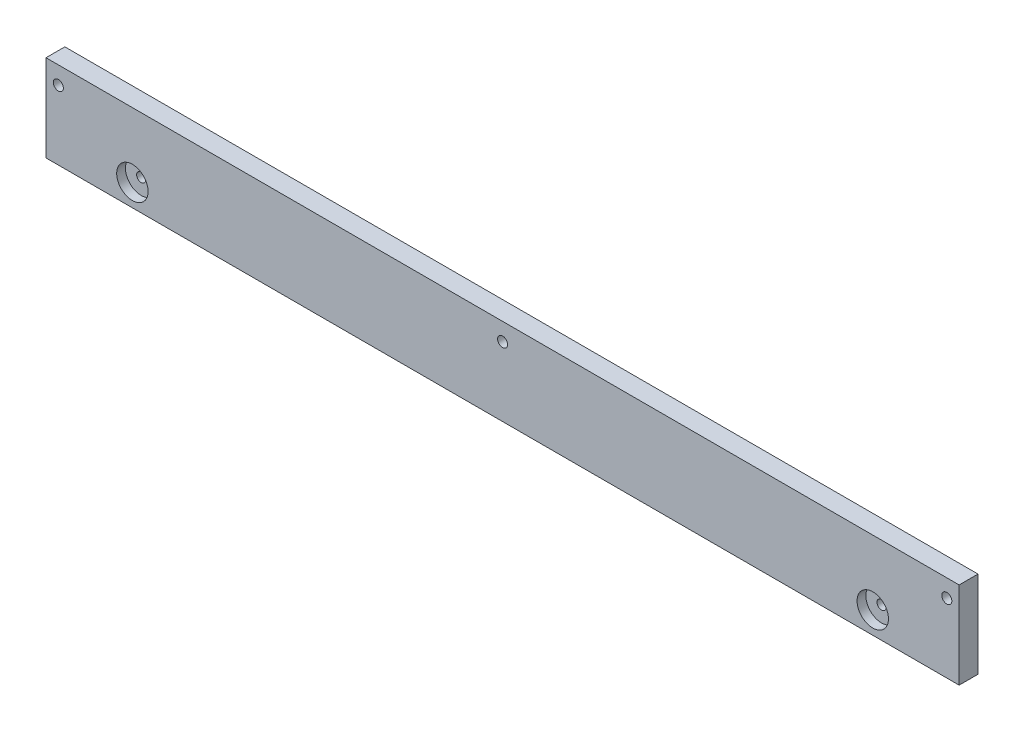
ISO-10303-21;
HEADER;
FILE_DESCRIPTION(('STEP AP214'),'2;1');
FILE_NAME('part.step','',(''),(''),'','','');
FILE_SCHEMA(('AUTOMOTIVE_DESIGN { 1 0 10303 214 1 1 1 1 }'));
ENDSEC;
DATA;
#1=APPLICATION_CONTEXT('core data for automotive mechanical design processes');
#2=APPLICATION_PROTOCOL_DEFINITION('international standard','automotive_design',2000,#1);
#3=PRODUCT_CONTEXT('',#1,'mechanical');
#4=PRODUCT('Part','Part','',(#3));
#5=PRODUCT_RELATED_PRODUCT_CATEGORY('part','',(#4));
#6=PRODUCT_DEFINITION_FORMATION('','',#4);
#7=PRODUCT_DEFINITION_CONTEXT('part definition',#1,'design');
#8=PRODUCT_DEFINITION('design','',#6,#7);
#9=PRODUCT_DEFINITION_SHAPE('','',#8);
#10=(LENGTH_UNIT() NAMED_UNIT(*) SI_UNIT(.MILLI.,.METRE.));
#11=(NAMED_UNIT(*) PLANE_ANGLE_UNIT() SI_UNIT($,.RADIAN.));
#12=(NAMED_UNIT(*) SI_UNIT($,.STERADIAN.) SOLID_ANGLE_UNIT());
#13=UNCERTAINTY_MEASURE_WITH_UNIT(LENGTH_MEASURE(1.E-05),#10,'distance_accuracy_value','');
#14=(GEOMETRIC_REPRESENTATION_CONTEXT(3) GLOBAL_UNCERTAINTY_ASSIGNED_CONTEXT((#13)) GLOBAL_UNIT_ASSIGNED_CONTEXT((#10,
#11,#12)) REPRESENTATION_CONTEXT('',''));
#15=CARTESIAN_POINT('',(0.,0.,0.));
#16=DIRECTION('',(0.,0.,1.));
#17=DIRECTION('',(1.,0.,0.));
#18=AXIS2_PLACEMENT_3D('',#15,#16,#17);
#19=CARTESIAN_POINT('',(-3.92699081749999,0.,6.));
#20=DIRECTION('',(0.,0.,1.));
#21=DIRECTION('',(1.,0.,0.));
#22=AXIS2_PLACEMENT_3D('',#19,#20,#21);
#23=PLANE('',#22);
#24=CARTESIAN_POINT('',(259.181393955,6.99999999999988,6.));
#25=DIRECTION('',(0.,0.,1.));
#26=DIRECTION('',(1.,0.,0.));
#27=AXIS2_PLACEMENT_3D('',#24,#25,#26);
#28=CIRCLE('',#27,4.99999999999999);
#29=CARTESIAN_POINT('',(264.181393955,6.99999999999988,6.));
#30=VERTEX_POINT('',#29);
#31=EDGE_CURVE('E253',#30,#30,#28,.T.);
#32=ORIENTED_EDGE('',*,*,#31,.F.);
#33=EDGE_LOOP('',(#32));
#34=FACE_BOUND('',#33,.T.);
#35=CARTESIAN_POINT('',(23.561944905,7.,6.));
#36=DIRECTION('',(0.,0.,1.));
#37=DIRECTION('',(1.,0.,0.));
#38=AXIS2_PLACEMENT_3D('',#35,#36,#37);
#39=CIRCLE('',#38,5.);
#40=CARTESIAN_POINT('',(28.561944905,7.,6.));
#41=VERTEX_POINT('',#40);
#42=EDGE_CURVE('E259',#41,#41,#39,.T.);
#43=ORIENTED_EDGE('',*,*,#42,.F.);
#44=EDGE_LOOP('',(#43));
#45=FACE_BOUND('',#44,.T.);
#46=CARTESIAN_POINT('',(141.37315521,21.9999999999999,6.));
#47=DIRECTION('',(0.,0.,1.));
#48=DIRECTION('',(1.,0.,0.));
#49=AXIS2_PLACEMENT_3D('',#46,#47,#48);
#50=CIRCLE('',#49,1.59999999999999);
#51=CARTESIAN_POINT('',(142.97315521,21.9999999999999,6.));
#52=VERTEX_POINT('',#51);
#53=EDGE_CURVE('E123',#52,#52,#50,.T.);
#54=ORIENTED_EDGE('',*,*,#53,.F.);
#55=EDGE_LOOP('',(#54));
#56=FACE_BOUND('',#55,.T.);
#57=DIRECTION('',(0.,-1.,0.));
#58=VECTOR('',#57,1.);
#59=CARTESIAN_POINT('',(-3.92699081749999,27.625,6.));
#60=LINE('',#59,#58);
#61=CARTESIAN_POINT('',(-3.92699081749999,27.625,6.));
#62=VERTEX_POINT('',#61);
#63=CARTESIAN_POINT('',(-3.92699081749999,0.,6.));
#64=VERTEX_POINT('',#63);
#65=EDGE_CURVE('E97',#62,#64,#60,.T.);
#66=ORIENTED_EDGE('',*,*,#65,.T.);
#67=DIRECTION('',(1.,0.,0.));
#68=VECTOR('',#67,1.);
#69=CARTESIAN_POINT('',(-3.92699081749999,0.,6.));
#70=LINE('',#69,#68);
#71=CARTESIAN_POINT('',(286.6703296775,0.,6.));
#72=VERTEX_POINT('',#71);
#73=EDGE_CURVE('E82',#64,#72,#70,.T.);
#74=ORIENTED_EDGE('',*,*,#73,.T.);
#75=DIRECTION('',(0.,1.,0.));
#76=VECTOR('',#75,1.);
#77=CARTESIAN_POINT('',(286.6703296775,27.625,6.));
#78=LINE('',#77,#76);
#79=CARTESIAN_POINT('',(286.6703296775,27.625,6.));
#80=VERTEX_POINT('',#79);
#81=EDGE_CURVE('E48',#72,#80,#78,.T.);
#82=ORIENTED_EDGE('',*,*,#81,.T.);
#83=DIRECTION('',(-1.,0.,0.));
#84=VECTOR('',#83,1.);
#85=CARTESIAN_POINT('',(-3.92699081749999,27.625,6.));
#86=LINE('',#85,#84);
#87=EDGE_CURVE('E43',#80,#62,#86,.T.);
#88=ORIENTED_EDGE('',*,*,#87,.T.);
#89=EDGE_LOOP('',(#66,#74,#82,#88));
#90=FACE_BOUND('',#89,.T.);
#91=CARTESIAN_POINT('',(0.,21.9999999999999,6.));
#92=DIRECTION('',(0.,0.,1.));
#93=DIRECTION('',(1.,0.,0.));
#94=AXIS2_PLACEMENT_3D('',#91,#92,#93);
#95=CIRCLE('',#94,1.6);
#96=CARTESIAN_POINT('',(1.6,21.9999999999999,6.));
#97=VERTEX_POINT('',#96);
#98=EDGE_CURVE('E87',#97,#97,#95,.T.);
#99=ORIENTED_EDGE('',*,*,#98,.F.);
#100=EDGE_LOOP('',(#99));
#101=FACE_BOUND('',#100,.T.);
#102=CARTESIAN_POINT('',(282.74333886,21.9999999999998,6.));
#103=DIRECTION('',(0.,0.,1.));
#104=DIRECTION('',(1.,0.,0.));
#105=AXIS2_PLACEMENT_3D('',#102,#103,#104);
#106=CIRCLE('',#105,1.59999999999996);
#107=CARTESIAN_POINT('',(284.34333886,21.9999999999998,6.));
#108=VERTEX_POINT('',#107);
#109=EDGE_CURVE('E117',#108,#108,#106,.T.);
#110=ORIENTED_EDGE('',*,*,#109,.F.);
#111=EDGE_LOOP('',(#110));
#112=FACE_BOUND('',#111,.T.);
#113=ADVANCED_FACE('F28',(#34,#45,#56,#90,#101,#112),#23,.T.);
#114=CARTESIAN_POINT('',(-3.92699081749999,0.,0.));
#115=DIRECTION('',(0.,0.,1.));
#116=DIRECTION('',(1.,0.,0.));
#117=AXIS2_PLACEMENT_3D('',#114,#115,#116);
#118=PLANE('',#117);
#119=CARTESIAN_POINT('',(141.37315521,21.9999999999999,0.));
#120=DIRECTION('',(0.,0.,1.));
#121=DIRECTION('',(1.,0.,0.));
#122=AXIS2_PLACEMENT_3D('',#119,#120,#121);
#123=CIRCLE('',#122,1.59999999999999);
#124=CARTESIAN_POINT('',(142.97315521,21.9999999999999,0.));
#125=VERTEX_POINT('',#124);
#126=EDGE_CURVE('E119',#125,#125,#123,.T.);
#127=ORIENTED_EDGE('',*,*,#126,.T.);
#128=EDGE_LOOP('',(#127));
#129=FACE_BOUND('',#128,.T.);
#130=DIRECTION('',(0.,-1.,0.));
#131=VECTOR('',#130,1.);
#132=CARTESIAN_POINT('',(-3.92699081749999,27.625,0.));
#133=LINE('',#132,#131);
#134=CARTESIAN_POINT('',(-3.92699081749999,27.625,0.));
#135=VERTEX_POINT('',#134);
#136=CARTESIAN_POINT('',(-3.92699081749999,0.,0.));
#137=VERTEX_POINT('',#136);
#138=EDGE_CURVE('E74',#135,#137,#133,.T.);
#139=ORIENTED_EDGE('',*,*,#138,.F.);
#140=DIRECTION('',(-1.,0.,0.));
#141=VECTOR('',#140,1.);
#142=CARTESIAN_POINT('',(-3.92699081749999,27.625,0.));
#143=LINE('',#142,#141);
#144=CARTESIAN_POINT('',(286.6703296775,27.625,0.));
#145=VERTEX_POINT('',#144);
#146=EDGE_CURVE('E95',#145,#135,#143,.T.);
#147=ORIENTED_EDGE('',*,*,#146,.F.);
#148=DIRECTION('',(0.,1.,0.));
#149=VECTOR('',#148,1.);
#150=CARTESIAN_POINT('',(286.6703296775,27.625,0.));
#151=LINE('',#150,#149);
#152=CARTESIAN_POINT('',(286.6703296775,0.,0.));
#153=VERTEX_POINT('',#152);
#154=EDGE_CURVE('E75',#153,#145,#151,.T.);
#155=ORIENTED_EDGE('',*,*,#154,.F.);
#156=DIRECTION('',(1.,0.,0.));
#157=VECTOR('',#156,1.);
#158=CARTESIAN_POINT('',(-3.92699081749999,0.,0.));
#159=LINE('',#158,#157);
#160=EDGE_CURVE('E69',#137,#153,#159,.T.);
#161=ORIENTED_EDGE('',*,*,#160,.F.);
#162=EDGE_LOOP('',(#139,#147,#155,#161));
#163=FACE_BOUND('',#162,.T.);
#164=CARTESIAN_POINT('',(0.,21.9999999999999,0.));
#165=DIRECTION('',(0.,0.,1.));
#166=DIRECTION('',(1.,0.,0.));
#167=AXIS2_PLACEMENT_3D('',#164,#165,#166);
#168=CIRCLE('',#167,1.6);
#169=CARTESIAN_POINT('',(1.6,21.9999999999999,0.));
#170=VERTEX_POINT('',#169);
#171=EDGE_CURVE('E90',#170,#170,#168,.T.);
#172=ORIENTED_EDGE('',*,*,#171,.T.);
#173=EDGE_LOOP('',(#172));
#174=FACE_BOUND('',#173,.T.);
#175=CARTESIAN_POINT('',(282.74333886,21.9999999999998,0.));
#176=DIRECTION('',(0.,0.,1.));
#177=DIRECTION('',(1.,0.,0.));
#178=AXIS2_PLACEMENT_3D('',#175,#176,#177);
#179=CIRCLE('',#178,1.59999999999996);
#180=CARTESIAN_POINT('',(284.34333886,21.9999999999998,0.));
#181=VERTEX_POINT('',#180);
#182=EDGE_CURVE('E120',#181,#181,#179,.T.);
#183=ORIENTED_EDGE('',*,*,#182,.T.);
#184=EDGE_LOOP('',(#183));
#185=FACE_BOUND('',#184,.T.);
#186=ADVANCED_FACE('F70',(#129,#163,#174,#185),#118,.F.);
#187=CARTESIAN_POINT('',(-3.92699081749999,27.625,6.));
#188=DIRECTION('',(1.,0.,0.));
#189=DIRECTION('',(0.,0.,-1.));
#190=AXIS2_PLACEMENT_3D('',#187,#188,#189);
#191=PLANE('',#190);
#192=ORIENTED_EDGE('',*,*,#138,.T.);
#193=DIRECTION('',(0.,0.,-1.));
#194=VECTOR('',#193,1.);
#195=CARTESIAN_POINT('',(-3.92699081749999,0.,6.));
#196=LINE('',#195,#194);
#197=EDGE_CURVE('E11',#64,#137,#196,.T.);
#198=ORIENTED_EDGE('',*,*,#197,.F.);
#199=ORIENTED_EDGE('',*,*,#65,.F.);
#200=DIRECTION('',(0.,0.,-1.));
#201=VECTOR('',#200,1.);
#202=CARTESIAN_POINT('',(-3.92699081749999,27.625,6.));
#203=LINE('',#202,#201);
#204=EDGE_CURVE('E86',#62,#135,#203,.T.);
#205=ORIENTED_EDGE('',*,*,#204,.T.);
#206=EDGE_LOOP('',(#192,#198,#199,#205));
#207=FACE_BOUND('',#206,.T.);
#208=ADVANCED_FACE('F30',(#207),#191,.F.);
#209=CARTESIAN_POINT('',(-3.92699081749999,0.,6.));
#210=DIRECTION('',(0.,1.,0.));
#211=DIRECTION('',(0.,0.,1.));
#212=AXIS2_PLACEMENT_3D('',#209,#210,#211);
#213=PLANE('',#212);
#214=ORIENTED_EDGE('',*,*,#160,.T.);
#215=DIRECTION('',(0.,0.,-1.));
#216=VECTOR('',#215,1.);
#217=CARTESIAN_POINT('',(286.6703296775,0.,6.));
#218=LINE('',#217,#216);
#219=EDGE_CURVE('E36',#72,#153,#218,.T.);
#220=ORIENTED_EDGE('',*,*,#219,.F.);
#221=ORIENTED_EDGE('',*,*,#73,.F.);
#222=ORIENTED_EDGE('',*,*,#197,.T.);
#223=EDGE_LOOP('',(#214,#220,#221,#222));
#224=FACE_BOUND('',#223,.T.);
#225=ADVANCED_FACE('F81',(#224),#213,.F.);
#226=CARTESIAN_POINT('',(286.6703296775,27.625,6.));
#227=DIRECTION('',(-1.,0.,0.));
#228=DIRECTION('',(0.,0.,1.));
#229=AXIS2_PLACEMENT_3D('',#226,#227,#228);
#230=PLANE('',#229);
#231=ORIENTED_EDGE('',*,*,#154,.T.);
#232=DIRECTION('',(0.,0.,-1.));
#233=VECTOR('',#232,1.);
#234=CARTESIAN_POINT('',(286.6703296775,27.625,6.));
#235=LINE('',#234,#233);
#236=EDGE_CURVE('E103',#80,#145,#235,.T.);
#237=ORIENTED_EDGE('',*,*,#236,.F.);
#238=ORIENTED_EDGE('',*,*,#81,.F.);
#239=ORIENTED_EDGE('',*,*,#219,.T.);
#240=EDGE_LOOP('',(#231,#237,#238,#239));
#241=FACE_BOUND('',#240,.T.);
#242=ADVANCED_FACE('F106',(#241),#230,.F.);
#243=CARTESIAN_POINT('',(-3.92699081749999,27.625,6.));
#244=DIRECTION('',(0.,-1.,0.));
#245=DIRECTION('',(0.,0.,-1.));
#246=AXIS2_PLACEMENT_3D('',#243,#244,#245);
#247=PLANE('',#246);
#248=ORIENTED_EDGE('',*,*,#146,.T.);
#249=ORIENTED_EDGE('',*,*,#204,.F.);
#250=ORIENTED_EDGE('',*,*,#87,.F.);
#251=ORIENTED_EDGE('',*,*,#236,.T.);
#252=EDGE_LOOP('',(#248,#249,#250,#251));
#253=FACE_BOUND('',#252,.T.);
#254=ADVANCED_FACE('F108',(#253),#247,.F.);
#255=CARTESIAN_POINT('',(0.,21.9999999999999,6.));
#256=DIRECTION('',(0.,0.,-1.));
#257=DIRECTION('',(-1.,0.,0.));
#258=AXIS2_PLACEMENT_3D('',#255,#256,#257);
#259=CYLINDRICAL_SURFACE('',#258,1.6);
#260=ORIENTED_EDGE('',*,*,#98,.T.);
#261=EDGE_LOOP('',(#260));
#262=FACE_BOUND('',#261,.T.);
#263=ORIENTED_EDGE('',*,*,#171,.F.);
#264=EDGE_LOOP('',(#263));
#265=FACE_BOUND('',#264,.T.);
#266=ADVANCED_FACE('F135',(#262,#265),#259,.F.);
#267=CARTESIAN_POINT('',(141.37315521,21.9999999999999,6.));
#268=DIRECTION('',(0.,0.,-1.));
#269=DIRECTION('',(-1.,0.,0.));
#270=AXIS2_PLACEMENT_3D('',#267,#268,#269);
#271=CYLINDRICAL_SURFACE('',#270,1.59999999999999);
#272=ORIENTED_EDGE('',*,*,#53,.T.);
#273=EDGE_LOOP('',(#272));
#274=FACE_BOUND('',#273,.T.);
#275=ORIENTED_EDGE('',*,*,#126,.F.);
#276=EDGE_LOOP('',(#275));
#277=FACE_BOUND('',#276,.T.);
#278=ADVANCED_FACE('F137',(#274,#277),#271,.F.);
#279=CARTESIAN_POINT('',(282.74333886,21.9999999999998,6.));
#280=DIRECTION('',(0.,0.,-1.));
#281=DIRECTION('',(-1.,0.,0.));
#282=AXIS2_PLACEMENT_3D('',#279,#280,#281);
#283=CYLINDRICAL_SURFACE('',#282,1.59999999999996);
#284=ORIENTED_EDGE('',*,*,#109,.T.);
#285=EDGE_LOOP('',(#284));
#286=FACE_BOUND('',#285,.T.);
#287=ORIENTED_EDGE('',*,*,#182,.F.);
#288=EDGE_LOOP('',(#287));
#289=FACE_BOUND('',#288,.T.);
#290=ADVANCED_FACE('F144',(#286,#289),#283,.F.);
#291=CARTESIAN_POINT('',(23.561944905,7.,3.2));
#292=DIRECTION('',(0.,0.,1.));
#293=DIRECTION('',(1.,0.,0.));
#294=AXIS2_PLACEMENT_3D('',#291,#292,#293);
#295=CYLINDRICAL_SURFACE('',#294,5.);
#296=CARTESIAN_POINT('',(23.561944905,7.,3.2));
#297=DIRECTION('',(0.,0.,1.));
#298=DIRECTION('',(1.,0.,0.));
#299=AXIS2_PLACEMENT_3D('',#296,#297,#298);
#300=CIRCLE('',#299,5.);
#301=CARTESIAN_POINT('',(28.561944905,7.,3.2));
#302=VERTEX_POINT('',#301);
#303=EDGE_CURVE('E126',#302,#302,#300,.T.);
#304=ORIENTED_EDGE('',*,*,#303,.F.);
#305=EDGE_LOOP('',(#304));
#306=FACE_BOUND('',#305,.T.);
#307=ORIENTED_EDGE('',*,*,#42,.T.);
#308=EDGE_LOOP('',(#307));
#309=FACE_BOUND('',#308,.T.);
#310=ADVANCED_FACE('F174',(#306,#309),#295,.F.);
#311=CARTESIAN_POINT('',(23.561944905,7.,3.2));
#312=DIRECTION('',(0.,0.,1.));
#313=DIRECTION('',(1.,0.,0.));
#314=AXIS2_PLACEMENT_3D('',#311,#312,#313);
#315=PLANE('',#314);
#316=CARTESIAN_POINT('',(23.561944905,7.,3.2));
#317=DIRECTION('',(0.,0.,1.));
#318=DIRECTION('',(1.,0.,0.));
#319=AXIS2_PLACEMENT_3D('',#316,#317,#318);
#320=CIRCLE('',#319,1.45);
#321=CARTESIAN_POINT('',(25.011944905,7.,3.2));
#322=VERTEX_POINT('',#321);
#323=EDGE_CURVE('E242',#322,#322,#320,.T.);
#324=ORIENTED_EDGE('',*,*,#323,.F.);
#325=EDGE_LOOP('',(#324));
#326=FACE_BOUND('',#325,.T.);
#327=ORIENTED_EDGE('',*,*,#303,.T.);
#328=EDGE_LOOP('',(#327));
#329=FACE_BOUND('',#328,.T.);
#330=ADVANCED_FACE('F178',(#326,#329),#315,.T.);
#331=CARTESIAN_POINT('',(259.181393955,6.99999999999988,3.2));
#332=DIRECTION('',(0.,0.,1.));
#333=DIRECTION('',(1.,0.,0.));
#334=AXIS2_PLACEMENT_3D('',#331,#332,#333);
#335=CYLINDRICAL_SURFACE('',#334,4.99999999999999);
#336=CARTESIAN_POINT('',(259.181393955,6.99999999999988,3.2));
#337=DIRECTION('',(0.,0.,1.));
#338=DIRECTION('',(1.,0.,0.));
#339=AXIS2_PLACEMENT_3D('',#336,#337,#338);
#340=CIRCLE('',#339,4.99999999999999);
#341=CARTESIAN_POINT('',(264.181393955,6.99999999999988,3.2));
#342=VERTEX_POINT('',#341);
#343=EDGE_CURVE('E256',#342,#342,#340,.T.);
#344=ORIENTED_EDGE('',*,*,#343,.F.);
#345=EDGE_LOOP('',(#344));
#346=FACE_BOUND('',#345,.T.);
#347=ORIENTED_EDGE('',*,*,#31,.T.);
#348=EDGE_LOOP('',(#347));
#349=FACE_BOUND('',#348,.T.);
#350=ADVANCED_FACE('F184',(#346,#349),#335,.F.);
#351=CARTESIAN_POINT('',(259.181393955,6.99999999999988,3.2));
#352=DIRECTION('',(0.,0.,1.));
#353=DIRECTION('',(1.,0.,0.));
#354=AXIS2_PLACEMENT_3D('',#351,#352,#353);
#355=PLANE('',#354);
#356=CARTESIAN_POINT('',(259.181393955,6.99999999999988,3.2));
#357=DIRECTION('',(0.,0.,1.));
#358=DIRECTION('',(1.,0.,0.));
#359=AXIS2_PLACEMENT_3D('',#356,#357,#358);
#360=CIRCLE('',#359,1.45);
#361=CARTESIAN_POINT('',(260.631393955,6.99999999999988,3.2));
#362=VERTEX_POINT('',#361);
#363=EDGE_CURVE('E243',#362,#362,#360,.T.);
#364=ORIENTED_EDGE('',*,*,#363,.F.);
#365=EDGE_LOOP('',(#364));
#366=FACE_BOUND('',#365,.T.);
#367=ORIENTED_EDGE('',*,*,#343,.T.);
#368=EDGE_LOOP('',(#367));
#369=FACE_BOUND('',#368,.T.);
#370=ADVANCED_FACE('F188',(#366,#369),#355,.T.);
#371=CARTESIAN_POINT('',(23.561944905,7.,0.7));
#372=DIRECTION('',(0.,0.,1.));
#373=DIRECTION('',(1.,0.,0.));
#374=AXIS2_PLACEMENT_3D('',#371,#372,#373);
#375=CYLINDRICAL_SURFACE('',#374,1.45);
#376=CARTESIAN_POINT('',(23.561944905,7.,0.7));
#377=DIRECTION('',(0.,0.,1.));
#378=DIRECTION('',(1.,0.,0.));
#379=AXIS2_PLACEMENT_3D('',#376,#377,#378);
#380=CIRCLE('',#379,1.45);
#381=CARTESIAN_POINT('',(25.011944905,7.,0.7));
#382=VERTEX_POINT('',#381);
#383=EDGE_CURVE('E246',#382,#382,#380,.T.);
#384=ORIENTED_EDGE('',*,*,#383,.F.);
#385=EDGE_LOOP('',(#384));
#386=FACE_BOUND('',#385,.T.);
#387=ORIENTED_EDGE('',*,*,#323,.T.);
#388=EDGE_LOOP('',(#387));
#389=FACE_BOUND('',#388,.T.);
#390=ADVANCED_FACE('F202',(#386,#389),#375,.F.);
#391=CARTESIAN_POINT('',(23.561944905,7.,0.7));
#392=DIRECTION('',(0.,0.,1.));
#393=DIRECTION('',(1.,0.,0.));
#394=AXIS2_PLACEMENT_3D('',#391,#392,#393);
#395=PLANE('',#394);
#396=ORIENTED_EDGE('',*,*,#383,.T.);
#397=EDGE_LOOP('',(#396));
#398=FACE_BOUND('',#397,.T.);
#399=ADVANCED_FACE('F210',(#398),#395,.T.);
#400=CARTESIAN_POINT('',(259.181393955,6.99999999999988,0.7));
#401=DIRECTION('',(0.,0.,1.));
#402=DIRECTION('',(1.,0.,0.));
#403=AXIS2_PLACEMENT_3D('',#400,#401,#402);
#404=CYLINDRICAL_SURFACE('',#403,1.45);
#405=CARTESIAN_POINT('',(259.181393955,6.99999999999988,0.7));
#406=DIRECTION('',(0.,0.,1.));
#407=DIRECTION('',(1.,0.,0.));
#408=AXIS2_PLACEMENT_3D('',#405,#406,#407);
#409=CIRCLE('',#408,1.45);
#410=CARTESIAN_POINT('',(260.631393955,6.99999999999988,0.7));
#411=VERTEX_POINT('',#410);
#412=EDGE_CURVE('E241',#411,#411,#409,.T.);
#413=ORIENTED_EDGE('',*,*,#412,.F.);
#414=EDGE_LOOP('',(#413));
#415=FACE_BOUND('',#414,.T.);
#416=ORIENTED_EDGE('',*,*,#363,.T.);
#417=EDGE_LOOP('',(#416));
#418=FACE_BOUND('',#417,.T.);
#419=ADVANCED_FACE('F218',(#415,#418),#404,.F.);
#420=CARTESIAN_POINT('',(259.181393955,6.99999999999988,0.7));
#421=DIRECTION('',(0.,0.,1.));
#422=DIRECTION('',(1.,0.,0.));
#423=AXIS2_PLACEMENT_3D('',#420,#421,#422);
#424=PLANE('',#423);
#425=ORIENTED_EDGE('',*,*,#412,.T.);
#426=EDGE_LOOP('',(#425));
#427=FACE_BOUND('',#426,.T.);
#428=ADVANCED_FACE('F226',(#427),#424,.T.);
#429=CLOSED_SHELL('',(#113,#186,#208,#225,#242,#254,#266,#278,#290,#310,#330,#350,#370,#390,
#399,#419,#428));
#430=MANIFOLD_SOLID_BREP('B2',#429);
#431=ADVANCED_BREP_SHAPE_REPRESENTATION('',(#18,#430),#14);
#432=SHAPE_DEFINITION_REPRESENTATION(#9,#431);
ENDSEC;
END-ISO-10303-21;
